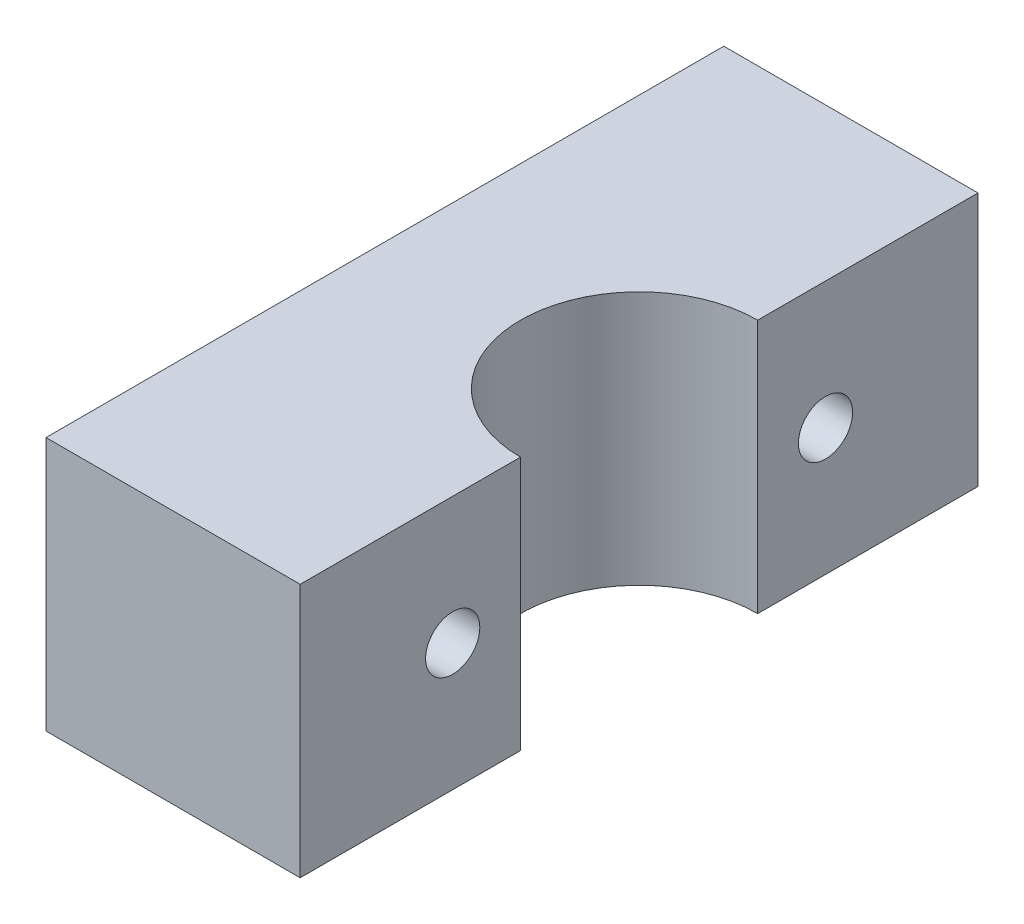
ISO-10303-21;
HEADER;
FILE_DESCRIPTION(('STEP AP214'),'2;1');
FILE_NAME('part.step','',(''),(''),'','','');
FILE_SCHEMA(('AUTOMOTIVE_DESIGN { 1 0 10303 214 1 1 1 1 }'));
ENDSEC;
DATA;
#1=APPLICATION_CONTEXT('core data for automotive mechanical design processes');
#2=APPLICATION_PROTOCOL_DEFINITION('international standard','automotive_design',2000,#1);
#3=PRODUCT_CONTEXT('',#1,'mechanical');
#4=PRODUCT('Part','Part','',(#3));
#5=PRODUCT_RELATED_PRODUCT_CATEGORY('part','',(#4));
#6=PRODUCT_DEFINITION_FORMATION('','',#4);
#7=PRODUCT_DEFINITION_CONTEXT('part definition',#1,'design');
#8=PRODUCT_DEFINITION('design','',#6,#7);
#9=PRODUCT_DEFINITION_SHAPE('','',#8);
#10=(LENGTH_UNIT() NAMED_UNIT(*) SI_UNIT(.MILLI.,.METRE.));
#11=(NAMED_UNIT(*) PLANE_ANGLE_UNIT() SI_UNIT($,.RADIAN.));
#12=(NAMED_UNIT(*) SI_UNIT($,.STERADIAN.) SOLID_ANGLE_UNIT());
#13=UNCERTAINTY_MEASURE_WITH_UNIT(LENGTH_MEASURE(1.E-05),#10,'distance_accuracy_value','');
#14=(GEOMETRIC_REPRESENTATION_CONTEXT(3) GLOBAL_UNCERTAINTY_ASSIGNED_CONTEXT((#13)) GLOBAL_UNIT_ASSIGNED_CONTEXT((#10,
#11,#12)) REPRESENTATION_CONTEXT('',''));
#15=CARTESIAN_POINT('',(0.,0.,0.));
#16=DIRECTION('',(0.,0.,1.));
#17=DIRECTION('',(1.,0.,0.));
#18=AXIS2_PLACEMENT_3D('',#15,#16,#17);
#19=CARTESIAN_POINT('',(-7.5,15.,20.));
#20=DIRECTION('',(1.,0.,0.));
#21=DIRECTION('',(0.,0.,-1.));
#22=AXIS2_PLACEMENT_3D('',#19,#20,#21);
#23=PLANE('',#22);
#24=CARTESIAN_POINT('',(-7.5,7.49999999999999,11.));
#25=DIRECTION('',(1.,0.,0.));
#26=DIRECTION('',(0.,0.,-1.));
#27=AXIS2_PLACEMENT_3D('',#24,#25,#26);
#28=CIRCLE('',#27,1.6);
#29=CARTESIAN_POINT('',(-7.5,7.49999999999999,9.40000000000003));
#30=VERTEX_POINT('',#29);
#31=EDGE_CURVE('E163',#30,#30,#28,.F.);
#32=ORIENTED_EDGE('',*,*,#31,.F.);
#33=EDGE_LOOP('',(#32));
#34=FACE_BOUND('',#33,.T.);
#35=CARTESIAN_POINT('',(-7.5,7.5,-11.));
#36=DIRECTION('',(1.,0.,0.));
#37=DIRECTION('',(0.,0.,-1.));
#38=AXIS2_PLACEMENT_3D('',#35,#36,#37);
#39=CIRCLE('',#38,1.6);
#40=CARTESIAN_POINT('',(-7.5,7.5,-12.6));
#41=VERTEX_POINT('',#40);
#42=EDGE_CURVE('E123',#41,#41,#39,.F.);
#43=ORIENTED_EDGE('',*,*,#42,.F.);
#44=EDGE_LOOP('',(#43));
#45=FACE_BOUND('',#44,.T.);
#46=DIRECTION('',(0.,0.,1.));
#47=VECTOR('',#46,1.);
#48=CARTESIAN_POINT('',(-7.5,0.,20.));
#49=LINE('',#48,#47);
#50=CARTESIAN_POINT('',(-7.5,0.,-20.));
#51=VERTEX_POINT('',#50);
#52=CARTESIAN_POINT('',(-7.5,0.,20.));
#53=VERTEX_POINT('',#52);
#54=EDGE_CURVE('E119',#51,#53,#49,.T.);
#55=ORIENTED_EDGE('',*,*,#54,.T.);
#56=DIRECTION('',(0.,-1.,0.));
#57=VECTOR('',#56,1.);
#58=CARTESIAN_POINT('',(-7.5,15.,20.));
#59=LINE('',#58,#57);
#60=CARTESIAN_POINT('',(-7.5,15.,20.));
#61=VERTEX_POINT('',#60);
#62=EDGE_CURVE('E11',#61,#53,#59,.T.);
#63=ORIENTED_EDGE('',*,*,#62,.F.);
#64=DIRECTION('',(0.,0.,1.));
#65=VECTOR('',#64,1.);
#66=CARTESIAN_POINT('',(-7.5,15.,20.));
#67=LINE('',#66,#65);
#68=CARTESIAN_POINT('',(-7.5,15.,-20.));
#69=VERTEX_POINT('',#68);
#70=EDGE_CURVE('E130',#69,#61,#67,.T.);
#71=ORIENTED_EDGE('',*,*,#70,.F.);
#72=DIRECTION('',(0.,-1.,0.));
#73=VECTOR('',#72,1.);
#74=CARTESIAN_POINT('',(-7.5,15.,-20.));
#75=LINE('',#74,#73);
#76=EDGE_CURVE('E115',#69,#51,#75,.T.);
#77=ORIENTED_EDGE('',*,*,#76,.T.);
#78=EDGE_LOOP('',(#55,#63,#71,#77));
#79=FACE_BOUND('',#78,.T.);
#80=ADVANCED_FACE('F35',(#34,#45,#79),#23,.F.);
#81=CARTESIAN_POINT('',(7.5,15.,20.));
#82=DIRECTION('',(0.,0.,-1.));
#83=DIRECTION('',(-1.,0.,0.));
#84=AXIS2_PLACEMENT_3D('',#81,#82,#83);
#85=PLANE('',#84);
#86=DIRECTION('',(1.,0.,0.));
#87=VECTOR('',#86,1.);
#88=CARTESIAN_POINT('',(7.5,0.,20.));
#89=LINE('',#88,#87);
#90=CARTESIAN_POINT('',(7.5,0.,20.));
#91=VERTEX_POINT('',#90);
#92=EDGE_CURVE('E122',#53,#91,#89,.T.);
#93=ORIENTED_EDGE('',*,*,#92,.T.);
#94=DIRECTION('',(0.,-1.,0.));
#95=VECTOR('',#94,1.);
#96=CARTESIAN_POINT('',(7.5,15.,20.));
#97=LINE('',#96,#95);
#98=CARTESIAN_POINT('',(7.5,15.,20.));
#99=VERTEX_POINT('',#98);
#100=EDGE_CURVE('E43',#99,#91,#97,.T.);
#101=ORIENTED_EDGE('',*,*,#100,.F.);
#102=DIRECTION('',(1.,0.,0.));
#103=VECTOR('',#102,1.);
#104=CARTESIAN_POINT('',(7.5,15.,20.));
#105=LINE('',#104,#103);
#106=EDGE_CURVE('E88',#61,#99,#105,.T.);
#107=ORIENTED_EDGE('',*,*,#106,.F.);
#108=ORIENTED_EDGE('',*,*,#62,.T.);
#109=EDGE_LOOP('',(#93,#101,#107,#108));
#110=FACE_BOUND('',#109,.T.);
#111=ADVANCED_FACE('F155',(#110),#85,.F.);
#112=CARTESIAN_POINT('',(7.5,15.,6.99999999999999));
#113=DIRECTION('',(-1.,0.,0.));
#114=DIRECTION('',(0.,0.,1.));
#115=AXIS2_PLACEMENT_3D('',#112,#113,#114);
#116=PLANE('',#115);
#117=CARTESIAN_POINT('',(7.50000000000001,7.49999999999999,11.));
#118=DIRECTION('',(1.,0.,0.));
#119=DIRECTION('',(0.,0.,-1.));
#120=AXIS2_PLACEMENT_3D('',#117,#118,#119);
#121=CIRCLE('',#120,1.6);
#122=CARTESIAN_POINT('',(7.50000000000001,7.49999999999999,9.40000000000001));
#123=VERTEX_POINT('',#122);
#124=EDGE_CURVE('E175',#123,#123,#121,.T.);
#125=ORIENTED_EDGE('',*,*,#124,.F.);
#126=EDGE_LOOP('',(#125));
#127=FACE_BOUND('',#126,.T.);
#128=DIRECTION('',(0.,0.,-1.));
#129=VECTOR('',#128,1.);
#130=CARTESIAN_POINT('',(7.5,0.,6.99999999999999));
#131=LINE('',#130,#129);
#132=CARTESIAN_POINT('',(7.5,0.,6.99999999999999));
#133=VERTEX_POINT('',#132);
#134=EDGE_CURVE('E125',#91,#133,#131,.T.);
#135=ORIENTED_EDGE('',*,*,#134,.T.);
#136=DIRECTION('',(0.,-1.,0.));
#137=VECTOR('',#136,1.);
#138=CARTESIAN_POINT('',(7.5,15.,6.99999999999999));
#139=LINE('',#138,#137);
#140=CARTESIAN_POINT('',(7.5,15.,6.99999999999999));
#141=VERTEX_POINT('',#140);
#142=EDGE_CURVE('E110',#141,#133,#139,.T.);
#143=ORIENTED_EDGE('',*,*,#142,.F.);
#144=DIRECTION('',(0.,0.,-1.));
#145=VECTOR('',#144,1.);
#146=CARTESIAN_POINT('',(7.5,15.,6.99999999999999));
#147=LINE('',#146,#145);
#148=EDGE_CURVE('E101',#99,#141,#147,.T.);
#149=ORIENTED_EDGE('',*,*,#148,.F.);
#150=ORIENTED_EDGE('',*,*,#100,.T.);
#151=EDGE_LOOP('',(#135,#143,#149,#150));
#152=FACE_BOUND('',#151,.T.);
#153=ADVANCED_FACE('F136',(#127,#152),#116,.F.);
#154=CARTESIAN_POINT('',(7.5,15.,0.));
#155=DIRECTION('',(0.,-1.,0.));
#156=DIRECTION('',(0.,0.,-1.));
#157=AXIS2_PLACEMENT_3D('',#154,#155,#156);
#158=CYLINDRICAL_SURFACE('',#157,7.);
#159=CARTESIAN_POINT('',(7.5,0.,0.));
#160=DIRECTION('',(0.,-1.,0.));
#161=DIRECTION('',(0.,0.,1.));
#162=AXIS2_PLACEMENT_3D('',#159,#160,#161);
#163=CIRCLE('',#162,7.);
#164=CARTESIAN_POINT('',(7.5,0.,-7.00000000000001));
#165=VERTEX_POINT('',#164);
#166=EDGE_CURVE('E109',#133,#165,#163,.T.);
#167=ORIENTED_EDGE('',*,*,#166,.T.);
#168=DIRECTION('',(0.,-1.,0.));
#169=VECTOR('',#168,1.);
#170=CARTESIAN_POINT('',(7.5,15.,-7.00000000000001));
#171=LINE('',#170,#169);
#172=CARTESIAN_POINT('',(7.5,15.,-7.00000000000001));
#173=VERTEX_POINT('',#172);
#174=EDGE_CURVE('E106',#173,#165,#171,.T.);
#175=ORIENTED_EDGE('',*,*,#174,.F.);
#176=CARTESIAN_POINT('',(7.5,15.,0.));
#177=DIRECTION('',(0.,-1.,0.));
#178=DIRECTION('',(0.,0.,1.));
#179=AXIS2_PLACEMENT_3D('',#176,#177,#178);
#180=CIRCLE('',#179,7.);
#181=EDGE_CURVE('E95',#141,#173,#180,.T.);
#182=ORIENTED_EDGE('',*,*,#181,.F.);
#183=ORIENTED_EDGE('',*,*,#142,.T.);
#184=EDGE_LOOP('',(#167,#175,#182,#183));
#185=FACE_BOUND('',#184,.T.);
#186=ADVANCED_FACE('F107',(#185),#158,.F.);
#187=CARTESIAN_POINT('',(7.5,15.,-20.));
#188=DIRECTION('',(-1.,0.,0.));
#189=DIRECTION('',(0.,0.,1.));
#190=AXIS2_PLACEMENT_3D('',#187,#188,#189);
#191=PLANE('',#190);
#192=CARTESIAN_POINT('',(7.49999999999999,7.5,-11.));
#193=DIRECTION('',(1.,0.,0.));
#194=DIRECTION('',(0.,0.,-1.));
#195=AXIS2_PLACEMENT_3D('',#192,#193,#194);
#196=CIRCLE('',#195,1.6);
#197=CARTESIAN_POINT('',(7.49999999999999,7.5,-12.6));
#198=VERTEX_POINT('',#197);
#199=EDGE_CURVE('E167',#198,#198,#196,.T.);
#200=ORIENTED_EDGE('',*,*,#199,.F.);
#201=EDGE_LOOP('',(#200));
#202=FACE_BOUND('',#201,.T.);
#203=DIRECTION('',(0.,0.,-1.));
#204=VECTOR('',#203,1.);
#205=CARTESIAN_POINT('',(7.5,0.,-20.));
#206=LINE('',#205,#204);
#207=CARTESIAN_POINT('',(7.5,0.,-20.));
#208=VERTEX_POINT('',#207);
#209=EDGE_CURVE('E74',#165,#208,#206,.T.);
#210=ORIENTED_EDGE('',*,*,#209,.T.);
#211=DIRECTION('',(0.,-1.,0.));
#212=VECTOR('',#211,1.);
#213=CARTESIAN_POINT('',(7.5,15.,-20.));
#214=LINE('',#213,#212);
#215=CARTESIAN_POINT('',(7.5,15.,-20.));
#216=VERTEX_POINT('',#215);
#217=EDGE_CURVE('E111',#216,#208,#214,.T.);
#218=ORIENTED_EDGE('',*,*,#217,.F.);
#219=DIRECTION('',(0.,0.,-1.));
#220=VECTOR('',#219,1.);
#221=CARTESIAN_POINT('',(7.5,15.,-20.));
#222=LINE('',#221,#220);
#223=EDGE_CURVE('E99',#173,#216,#222,.T.);
#224=ORIENTED_EDGE('',*,*,#223,.F.);
#225=ORIENTED_EDGE('',*,*,#174,.T.);
#226=EDGE_LOOP('',(#210,#218,#224,#225));
#227=FACE_BOUND('',#226,.T.);
#228=ADVANCED_FACE('F113',(#202,#227),#191,.F.);
#229=CARTESIAN_POINT('',(7.5,15.,-20.));
#230=DIRECTION('',(0.,0.,1.));
#231=DIRECTION('',(1.,0.,0.));
#232=AXIS2_PLACEMENT_3D('',#229,#230,#231);
#233=PLANE('',#232);
#234=DIRECTION('',(-1.,0.,0.));
#235=VECTOR('',#234,1.);
#236=CARTESIAN_POINT('',(7.5,0.,-20.));
#237=LINE('',#236,#235);
#238=EDGE_CURVE('E80',#208,#51,#237,.T.);
#239=ORIENTED_EDGE('',*,*,#238,.T.);
#240=ORIENTED_EDGE('',*,*,#76,.F.);
#241=DIRECTION('',(-1.,0.,0.));
#242=VECTOR('',#241,1.);
#243=CARTESIAN_POINT('',(7.5,15.,-20.));
#244=LINE('',#243,#242);
#245=EDGE_CURVE('E51',#216,#69,#244,.T.);
#246=ORIENTED_EDGE('',*,*,#245,.F.);
#247=ORIENTED_EDGE('',*,*,#217,.T.);
#248=EDGE_LOOP('',(#239,#240,#246,#247));
#249=FACE_BOUND('',#248,.T.);
#250=ADVANCED_FACE('F143',(#249),#233,.F.);
#251=CARTESIAN_POINT('',(7.5,15.,0.));
#252=DIRECTION('',(0.,1.,0.));
#253=DIRECTION('',(0.,0.,1.));
#254=AXIS2_PLACEMENT_3D('',#251,#252,#253);
#255=PLANE('',#254);
#256=ORIENTED_EDGE('',*,*,#70,.T.);
#257=ORIENTED_EDGE('',*,*,#106,.T.);
#258=ORIENTED_EDGE('',*,*,#148,.T.);
#259=ORIENTED_EDGE('',*,*,#181,.T.);
#260=ORIENTED_EDGE('',*,*,#223,.T.);
#261=ORIENTED_EDGE('',*,*,#245,.T.);
#262=EDGE_LOOP('',(#256,#257,#258,#259,#260,#261));
#263=FACE_BOUND('',#262,.T.);
#264=ADVANCED_FACE('F97',(#263),#255,.T.);
#265=CARTESIAN_POINT('',(7.5,0.,0.));
#266=DIRECTION('',(0.,1.,0.));
#267=DIRECTION('',(0.,0.,1.));
#268=AXIS2_PLACEMENT_3D('',#265,#266,#267);
#269=PLANE('',#268);
#270=ORIENTED_EDGE('',*,*,#54,.F.);
#271=ORIENTED_EDGE('',*,*,#238,.F.);
#272=ORIENTED_EDGE('',*,*,#209,.F.);
#273=ORIENTED_EDGE('',*,*,#166,.F.);
#274=ORIENTED_EDGE('',*,*,#134,.F.);
#275=ORIENTED_EDGE('',*,*,#92,.F.);
#276=EDGE_LOOP('',(#270,#271,#272,#273,#274,#275));
#277=FACE_BOUND('',#276,.T.);
#278=ADVANCED_FACE('F139',(#277),#269,.F.);
#279=CARTESIAN_POINT('',(-7.50100000000002,7.5,-11.));
#280=DIRECTION('',(1.,0.,0.));
#281=DIRECTION('',(0.,0.,-1.));
#282=AXIS2_PLACEMENT_3D('',#279,#280,#281);
#283=CYLINDRICAL_SURFACE('',#282,1.6);
#284=ORIENTED_EDGE('',*,*,#199,.T.);
#285=EDGE_LOOP('',(#284));
#286=FACE_BOUND('',#285,.T.);
#287=ORIENTED_EDGE('',*,*,#42,.T.);
#288=EDGE_LOOP('',(#287));
#289=FACE_BOUND('',#288,.T.);
#290=ADVANCED_FACE('F203',(#286,#289),#283,.F.);
#291=CARTESIAN_POINT('',(-7.50100000000001,7.49999999999999,11.));
#292=DIRECTION('',(1.,0.,0.));
#293=DIRECTION('',(0.,0.,-1.));
#294=AXIS2_PLACEMENT_3D('',#291,#292,#293);
#295=CYLINDRICAL_SURFACE('',#294,1.6);
#296=ORIENTED_EDGE('',*,*,#124,.T.);
#297=EDGE_LOOP('',(#296));
#298=FACE_BOUND('',#297,.T.);
#299=ORIENTED_EDGE('',*,*,#31,.T.);
#300=EDGE_LOOP('',(#299));
#301=FACE_BOUND('',#300,.T.);
#302=ADVANCED_FACE('F179',(#298,#301),#295,.F.);
#303=CLOSED_SHELL('',(#80,#111,#153,#186,#228,#250,#264,#278,#290,#302));
#304=MANIFOLD_SOLID_BREP('B2',#303);
#305=ADVANCED_BREP_SHAPE_REPRESENTATION('',(#18,#304),#14);
#306=SHAPE_DEFINITION_REPRESENTATION(#9,#305);
ENDSEC;
END-ISO-10303-21;
